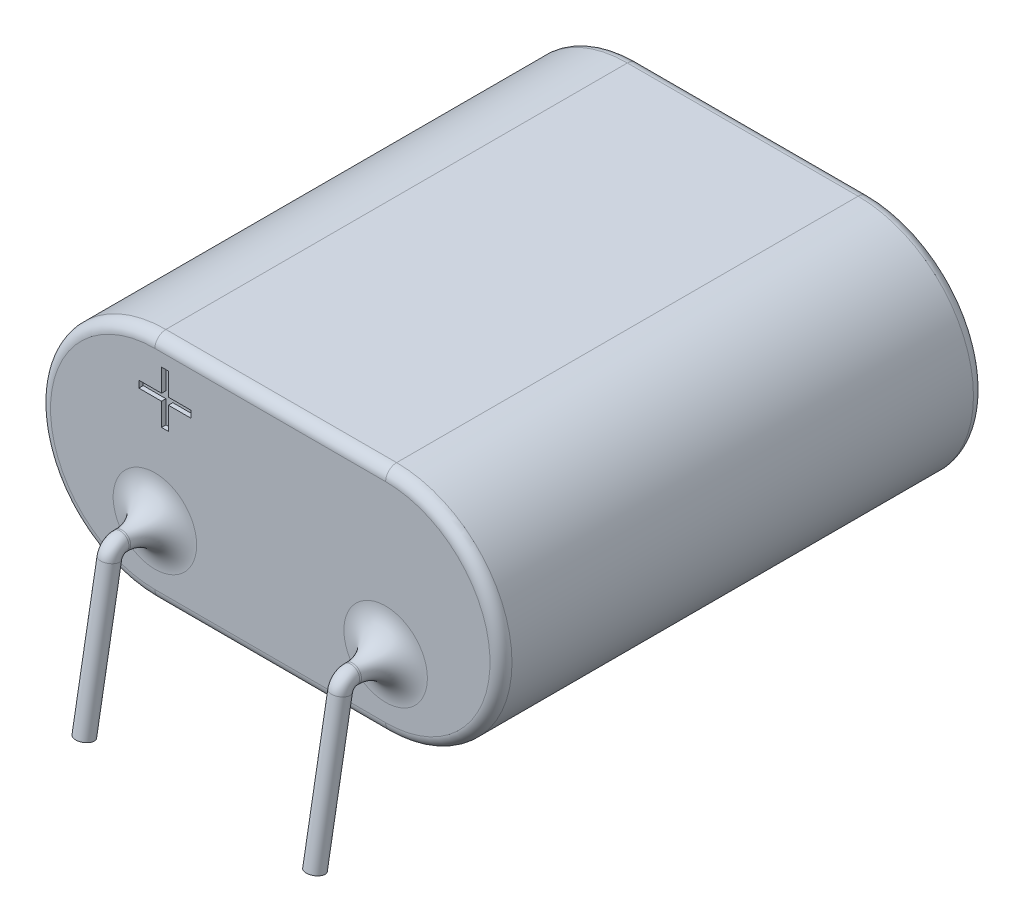
ISO-10303-21;
HEADER;
FILE_DESCRIPTION(('STEP AP214'),'2;1');
FILE_NAME('part.step','',(''),(''),'','','');
FILE_SCHEMA(('AUTOMOTIVE_DESIGN { 1 0 10303 214 1 1 1 1 }'));
ENDSEC;
DATA;
#1=APPLICATION_CONTEXT('core data for automotive mechanical design processes');
#2=APPLICATION_PROTOCOL_DEFINITION('international standard','automotive_design',2000,#1);
#3=PRODUCT_CONTEXT('',#1,'mechanical');
#4=PRODUCT('Part','Part','',(#3));
#5=PRODUCT_RELATED_PRODUCT_CATEGORY('part','',(#4));
#6=PRODUCT_DEFINITION_FORMATION('','',#4);
#7=PRODUCT_DEFINITION_CONTEXT('part definition',#1,'design');
#8=PRODUCT_DEFINITION('design','',#6,#7);
#9=PRODUCT_DEFINITION_SHAPE('','',#8);
#10=(LENGTH_UNIT() NAMED_UNIT(*) SI_UNIT(.MILLI.,.METRE.));
#11=(NAMED_UNIT(*) PLANE_ANGLE_UNIT() SI_UNIT($,.RADIAN.));
#12=(NAMED_UNIT(*) SI_UNIT($,.STERADIAN.) SOLID_ANGLE_UNIT());
#13=UNCERTAINTY_MEASURE_WITH_UNIT(LENGTH_MEASURE(1.E-05),#10,'distance_accuracy_value','');
#14=(GEOMETRIC_REPRESENTATION_CONTEXT(3) GLOBAL_UNCERTAINTY_ASSIGNED_CONTEXT((#13)) GLOBAL_UNIT_ASSIGNED_CONTEXT((#10,
#11,#12)) REPRESENTATION_CONTEXT('',''));
#15=CARTESIAN_POINT('',(0.,0.,0.));
#16=DIRECTION('',(0.,0.,1.));
#17=DIRECTION('',(1.,0.,0.));
#18=AXIS2_PLACEMENT_3D('',#15,#16,#17);
#19=CARTESIAN_POINT('',(0.,0.,0.));
#20=DIRECTION('',(0.,0.,1.));
#21=DIRECTION('',(1.,0.,0.));
#22=AXIS2_PLACEMENT_3D('',#19,#20,#21);
#23=PLANE('',#22);
#24=CARTESIAN_POINT('',(10.5,0.,0.));
#25=DIRECTION('',(0.,0.,1.));
#26=DIRECTION('',(1.,0.,0.));
#27=AXIS2_PLACEMENT_3D('',#24,#25,#26);
#28=CIRCLE('',#27,4.75);
#29=CARTESIAN_POINT('',(10.5,-4.75,0.));
#30=VERTEX_POINT('',#29);
#31=CARTESIAN_POINT('',(10.5,4.75,0.));
#32=VERTEX_POINT('',#31);
#33=EDGE_CURVE('E51',#30,#32,#28,.T.);
#34=ORIENTED_EDGE('',*,*,#33,.T.);
#35=DIRECTION('',(-1.,0.,0.));
#36=VECTOR('',#35,1.);
#37=CARTESIAN_POINT('',(0.,4.75,0.));
#38=LINE('',#37,#36);
#39=CARTESIAN_POINT('',(0.,4.75,0.));
#40=VERTEX_POINT('',#39);
#41=EDGE_CURVE('E11',#32,#40,#38,.T.);
#42=ORIENTED_EDGE('',*,*,#41,.T.);
#43=CARTESIAN_POINT('',(0.,0.,0.));
#44=DIRECTION('',(0.,0.,1.));
#45=DIRECTION('',(1.,0.,0.));
#46=AXIS2_PLACEMENT_3D('',#43,#44,#45);
#47=CIRCLE('',#46,4.75);
#48=CARTESIAN_POINT('',(0.,-4.75,0.));
#49=VERTEX_POINT('',#48);
#50=EDGE_CURVE('E311',#40,#49,#47,.T.);
#51=ORIENTED_EDGE('',*,*,#50,.T.);
#52=DIRECTION('',(1.,0.,0.));
#53=VECTOR('',#52,1.);
#54=CARTESIAN_POINT('',(0.,-4.75,0.));
#55=LINE('',#54,#53);
#56=EDGE_CURVE('E314',#49,#30,#55,.T.);
#57=ORIENTED_EDGE('',*,*,#56,.T.);
#58=EDGE_LOOP('',(#34,#42,#51,#57));
#59=FACE_BOUND('',#58,.T.);
#60=CARTESIAN_POINT('',(10.5,-2.05,0.));
#61=DIRECTION('',(0.,0.,1.));
#62=DIRECTION('',(1.,0.,0.));
#63=AXIS2_PLACEMENT_3D('',#60,#61,#62);
#64=CIRCLE('',#63,1.9);
#65=CARTESIAN_POINT('',(12.4,-2.05,0.));
#66=VERTEX_POINT('',#65);
#67=EDGE_CURVE('E264',#66,#66,#64,.F.);
#68=ORIENTED_EDGE('',*,*,#67,.T.);
#69=EDGE_LOOP('',(#68));
#70=FACE_BOUND('',#69,.T.);
#71=CARTESIAN_POINT('',(0.,-2.05,0.));
#72=DIRECTION('',(0.,0.,1.));
#73=DIRECTION('',(1.,0.,0.));
#74=AXIS2_PLACEMENT_3D('',#71,#72,#73);
#75=CIRCLE('',#74,1.9);
#76=CARTESIAN_POINT('',(1.9,-2.05,0.));
#77=VERTEX_POINT('',#76);
#78=EDGE_CURVE('E260',#77,#77,#75,.F.);
#79=ORIENTED_EDGE('',*,*,#78,.T.);
#80=EDGE_LOOP('',(#79));
#81=FACE_BOUND('',#80,.T.);
#82=DIRECTION('',(0.,1.,0.));
#83=VECTOR('',#82,1.);
#84=CARTESIAN_POINT('',(-0.73076923076923,2.82051282051282,0.));
#85=LINE('',#84,#83);
#86=CARTESIAN_POINT('',(-0.73076923076923,2.82051282051282,0.));
#87=VERTEX_POINT('',#86);
#88=CARTESIAN_POINT('',(-0.73076923076923,3.13461538461538,0.));
#89=VERTEX_POINT('',#88);
#90=EDGE_CURVE('E198',#87,#89,#85,.T.);
#91=ORIENTED_EDGE('',*,*,#90,.T.);
#92=DIRECTION('',(1.,0.,0.));
#93=VECTOR('',#92,1.);
#94=CARTESIAN_POINT('',(-0.73076923076923,3.13461538461538,0.));
#95=LINE('',#94,#93);
#96=CARTESIAN_POINT('',(0.301282051282052,3.13461538461538,0.));
#97=VERTEX_POINT('',#96);
#98=EDGE_CURVE('E59',#89,#97,#95,.T.);
#99=ORIENTED_EDGE('',*,*,#98,.T.);
#100=DIRECTION('',(0.,1.,0.));
#101=VECTOR('',#100,1.);
#102=CARTESIAN_POINT('',(0.301282051282052,3.13461538461538,0.));
#103=LINE('',#102,#101);
#104=CARTESIAN_POINT('',(0.301282051282052,4.16666666666667,0.));
#105=VERTEX_POINT('',#104);
#106=EDGE_CURVE('E202',#97,#105,#103,.T.);
#107=ORIENTED_EDGE('',*,*,#106,.T.);
#108=DIRECTION('',(1.,0.,0.));
#109=VECTOR('',#108,1.);
#110=CARTESIAN_POINT('',(0.301282051282052,4.16666666666667,0.));
#111=LINE('',#110,#109);
#112=CARTESIAN_POINT('',(0.615384615384616,4.16666666666667,0.));
#113=VERTEX_POINT('',#112);
#114=EDGE_CURVE('E752',#105,#113,#111,.T.);
#115=ORIENTED_EDGE('',*,*,#114,.T.);
#116=DIRECTION('',(0.,-1.,0.));
#117=VECTOR('',#116,1.);
#118=CARTESIAN_POINT('',(0.615384615384616,4.16666666666667,0.));
#119=LINE('',#118,#117);
#120=CARTESIAN_POINT('',(0.615384615384616,3.13461538461538,0.));
#121=VERTEX_POINT('',#120);
#122=EDGE_CURVE('E754',#113,#121,#119,.T.);
#123=ORIENTED_EDGE('',*,*,#122,.T.);
#124=DIRECTION('',(1.,0.,0.));
#125=VECTOR('',#124,1.);
#126=CARTESIAN_POINT('',(0.615384615384616,3.13461538461538,0.));
#127=LINE('',#126,#125);
#128=CARTESIAN_POINT('',(1.6474358974359,3.13461538461538,0.));
#129=VERTEX_POINT('',#128);
#130=EDGE_CURVE('E759',#121,#129,#127,.T.);
#131=ORIENTED_EDGE('',*,*,#130,.T.);
#132=DIRECTION('',(0.,-1.,0.));
#133=VECTOR('',#132,1.);
#134=CARTESIAN_POINT('',(1.6474358974359,3.13461538461538,0.));
#135=LINE('',#134,#133);
#136=CARTESIAN_POINT('',(1.6474358974359,2.82051282051282,0.));
#137=VERTEX_POINT('',#136);
#138=EDGE_CURVE('E769',#129,#137,#135,.T.);
#139=ORIENTED_EDGE('',*,*,#138,.T.);
#140=DIRECTION('',(-1.,0.,0.));
#141=VECTOR('',#140,1.);
#142=CARTESIAN_POINT('',(1.6474358974359,2.82051282051282,0.));
#143=LINE('',#142,#141);
#144=CARTESIAN_POINT('',(0.615384615384616,2.82051282051282,0.));
#145=VERTEX_POINT('',#144);
#146=EDGE_CURVE('E773',#137,#145,#143,.T.);
#147=ORIENTED_EDGE('',*,*,#146,.T.);
#148=DIRECTION('',(0.,-1.,0.));
#149=VECTOR('',#148,1.);
#150=CARTESIAN_POINT('',(0.615384615384616,2.82051282051282,0.));
#151=LINE('',#150,#149);
#152=CARTESIAN_POINT('',(0.615384615384616,1.78846153846154,0.));
#153=VERTEX_POINT('',#152);
#154=EDGE_CURVE('E777',#145,#153,#151,.T.);
#155=ORIENTED_EDGE('',*,*,#154,.T.);
#156=DIRECTION('',(-1.,0.,0.));
#157=VECTOR('',#156,1.);
#158=CARTESIAN_POINT('',(0.615384615384616,1.78846153846154,0.));
#159=LINE('',#158,#157);
#160=CARTESIAN_POINT('',(0.301282051282052,1.78846153846154,0.));
#161=VERTEX_POINT('',#160);
#162=EDGE_CURVE('E718',#153,#161,#159,.T.);
#163=ORIENTED_EDGE('',*,*,#162,.T.);
#164=DIRECTION('',(0.,1.,0.));
#165=VECTOR('',#164,1.);
#166=CARTESIAN_POINT('',(0.301282051282052,1.78846153846154,0.));
#167=LINE('',#166,#165);
#168=CARTESIAN_POINT('',(0.301282051282052,2.82051282051282,0.));
#169=VERTEX_POINT('',#168);
#170=EDGE_CURVE('E713',#161,#169,#167,.T.);
#171=ORIENTED_EDGE('',*,*,#170,.T.);
#172=DIRECTION('',(-1.,0.,0.));
#173=VECTOR('',#172,1.);
#174=CARTESIAN_POINT('',(0.301282051282052,2.82051282051282,0.));
#175=LINE('',#174,#173);
#176=EDGE_CURVE('E707',#169,#87,#175,.T.);
#177=ORIENTED_EDGE('',*,*,#176,.T.);
#178=EDGE_LOOP('',(#91,#99,#107,#115,#123,#131,#139,#147,#155,#163,#171,#177));
#179=FACE_BOUND('',#178,.T.);
#180=ADVANCED_FACE('F41',(#59,#70,#81,#179),#23,.T.);
#181=CARTESIAN_POINT('',(0.,0.,-22.));
#182=DIRECTION('',(0.,0.,1.));
#183=DIRECTION('',(1.,0.,0.));
#184=AXIS2_PLACEMENT_3D('',#181,#182,#183);
#185=CYLINDRICAL_SURFACE('',#184,5.25);
#186=DIRECTION('',(0.,0.,1.));
#187=VECTOR('',#186,1.);
#188=CARTESIAN_POINT('',(0.,5.25,-22.));
#189=LINE('',#188,#187);
#190=CARTESIAN_POINT('',(0.,5.25,-21.5));
#191=VERTEX_POINT('',#190);
#192=CARTESIAN_POINT('',(0.,5.25,-0.5));
#193=VERTEX_POINT('',#192);
#194=EDGE_CURVE('E241',#191,#193,#189,.T.);
#195=ORIENTED_EDGE('',*,*,#194,.F.);
#196=CARTESIAN_POINT('',(0.,0.,-21.5));
#197=DIRECTION('',(0.,0.,1.));
#198=DIRECTION('',(1.,0.,0.));
#199=AXIS2_PLACEMENT_3D('',#196,#197,#198);
#200=CIRCLE('',#199,5.25);
#201=CARTESIAN_POINT('',(0.,-5.25,-21.5));
#202=VERTEX_POINT('',#201);
#203=EDGE_CURVE('E308',#191,#202,#200,.T.);
#204=ORIENTED_EDGE('',*,*,#203,.T.);
#205=DIRECTION('',(0.,0.,1.));
#206=VECTOR('',#205,1.);
#207=CARTESIAN_POINT('',(0.,-5.25,-22.));
#208=LINE('',#207,#206);
#209=CARTESIAN_POINT('',(0.,-5.25,-0.5));
#210=VERTEX_POINT('',#209);
#211=EDGE_CURVE('E240',#202,#210,#208,.T.);
#212=ORIENTED_EDGE('',*,*,#211,.T.);
#213=CARTESIAN_POINT('',(0.,0.,-0.5));
#214=DIRECTION('',(0.,0.,1.));
#215=DIRECTION('',(1.,0.,0.));
#216=AXIS2_PLACEMENT_3D('',#213,#214,#215);
#217=CIRCLE('',#216,5.25);
#218=EDGE_CURVE('E305',#210,#193,#217,.F.);
#219=ORIENTED_EDGE('',*,*,#218,.T.);
#220=EDGE_LOOP('',(#195,#204,#212,#219));
#221=FACE_BOUND('',#220,.T.);
#222=ADVANCED_FACE('F356',(#221),#185,.T.);
#223=CARTESIAN_POINT('',(0.,5.25,-22.));
#224=DIRECTION('',(0.,1.,0.));
#225=DIRECTION('',(-1.,0.,0.));
#226=AXIS2_PLACEMENT_3D('',#223,#224,#225);
#227=PLANE('',#226);
#228=DIRECTION('',(0.,0.,1.));
#229=VECTOR('',#228,1.);
#230=CARTESIAN_POINT('',(10.5,5.25,-22.));
#231=LINE('',#230,#229);
#232=CARTESIAN_POINT('',(10.5,5.25,-21.5));
#233=VERTEX_POINT('',#232);
#234=CARTESIAN_POINT('',(10.5,5.25,-0.5));
#235=VERTEX_POINT('',#234);
#236=EDGE_CURVE('E246',#233,#235,#231,.T.);
#237=ORIENTED_EDGE('',*,*,#236,.F.);
#238=DIRECTION('',(-1.,0.,0.));
#239=VECTOR('',#238,1.);
#240=CARTESIAN_POINT('',(0.,5.25,-21.5));
#241=LINE('',#240,#239);
#242=EDGE_CURVE('E302',#233,#191,#241,.T.);
#243=ORIENTED_EDGE('',*,*,#242,.T.);
#244=ORIENTED_EDGE('',*,*,#194,.T.);
#245=DIRECTION('',(-1.,0.,0.));
#246=VECTOR('',#245,1.);
#247=CARTESIAN_POINT('',(0.,5.25,-0.5));
#248=LINE('',#247,#246);
#249=EDGE_CURVE('E298',#193,#235,#248,.F.);
#250=ORIENTED_EDGE('',*,*,#249,.T.);
#251=EDGE_LOOP('',(#237,#243,#244,#250));
#252=FACE_BOUND('',#251,.T.);
#253=ADVANCED_FACE('F373',(#252),#227,.T.);
#254=CARTESIAN_POINT('',(10.5,0.,-22.));
#255=DIRECTION('',(0.,0.,1.));
#256=DIRECTION('',(1.,0.,0.));
#257=AXIS2_PLACEMENT_3D('',#254,#255,#256);
#258=CYLINDRICAL_SURFACE('',#257,5.25);
#259=DIRECTION('',(0.,0.,1.));
#260=VECTOR('',#259,1.);
#261=CARTESIAN_POINT('',(10.5,-5.25,-22.));
#262=LINE('',#261,#260);
#263=CARTESIAN_POINT('',(10.5,-5.25,-21.5));
#264=VERTEX_POINT('',#263);
#265=CARTESIAN_POINT('',(10.5,-5.25,-0.5));
#266=VERTEX_POINT('',#265);
#267=EDGE_CURVE('E250',#264,#266,#262,.T.);
#268=ORIENTED_EDGE('',*,*,#267,.F.);
#269=CARTESIAN_POINT('',(10.5,0.,-21.5));
#270=DIRECTION('',(0.,0.,1.));
#271=DIRECTION('',(1.,0.,0.));
#272=AXIS2_PLACEMENT_3D('',#269,#270,#271);
#273=CIRCLE('',#272,5.25);
#274=EDGE_CURVE('E295',#264,#233,#273,.T.);
#275=ORIENTED_EDGE('',*,*,#274,.T.);
#276=ORIENTED_EDGE('',*,*,#236,.T.);
#277=CARTESIAN_POINT('',(10.5,0.,-0.5));
#278=DIRECTION('',(0.,0.,1.));
#279=DIRECTION('',(1.,0.,0.));
#280=AXIS2_PLACEMENT_3D('',#277,#278,#279);
#281=CIRCLE('',#280,5.25);
#282=EDGE_CURVE('E292',#235,#266,#281,.F.);
#283=ORIENTED_EDGE('',*,*,#282,.T.);
#284=EDGE_LOOP('',(#268,#275,#276,#283));
#285=FACE_BOUND('',#284,.T.);
#286=ADVANCED_FACE('F369',(#285),#258,.T.);
#287=CARTESIAN_POINT('',(0.,-5.25,-22.));
#288=DIRECTION('',(0.,-1.,0.));
#289=DIRECTION('',(1.,0.,0.));
#290=AXIS2_PLACEMENT_3D('',#287,#288,#289);
#291=PLANE('',#290);
#292=ORIENTED_EDGE('',*,*,#211,.F.);
#293=DIRECTION('',(1.,0.,0.));
#294=VECTOR('',#293,1.);
#295=CARTESIAN_POINT('',(10.5,-5.25,-21.5));
#296=LINE('',#295,#294);
#297=EDGE_CURVE('E275',#202,#264,#296,.T.);
#298=ORIENTED_EDGE('',*,*,#297,.T.);
#299=ORIENTED_EDGE('',*,*,#267,.T.);
#300=DIRECTION('',(1.,0.,0.));
#301=VECTOR('',#300,1.);
#302=CARTESIAN_POINT('',(0.,-5.25,-0.5));
#303=LINE('',#302,#301);
#304=EDGE_CURVE('E272',#266,#210,#303,.F.);
#305=ORIENTED_EDGE('',*,*,#304,.T.);
#306=EDGE_LOOP('',(#292,#298,#299,#305));
#307=FACE_BOUND('',#306,.T.);
#308=ADVANCED_FACE('F351',(#307),#291,.T.);
#309=CARTESIAN_POINT('',(0.,0.,-22.));
#310=DIRECTION('',(0.,0.,1.));
#311=DIRECTION('',(1.,0.,0.));
#312=AXIS2_PLACEMENT_3D('',#309,#310,#311);
#313=PLANE('',#312);
#314=CARTESIAN_POINT('',(10.5,0.,-22.));
#315=DIRECTION('',(0.,0.,1.));
#316=DIRECTION('',(1.,0.,0.));
#317=AXIS2_PLACEMENT_3D('',#314,#315,#316);
#318=CIRCLE('',#317,4.75);
#319=CARTESIAN_POINT('',(10.5,4.75,-22.));
#320=VERTEX_POINT('',#319);
#321=CARTESIAN_POINT('',(10.5,-4.75,-22.));
#322=VERTEX_POINT('',#321);
#323=EDGE_CURVE('E285',#320,#322,#318,.F.);
#324=ORIENTED_EDGE('',*,*,#323,.T.);
#325=DIRECTION('',(1.,0.,0.));
#326=VECTOR('',#325,1.);
#327=CARTESIAN_POINT('',(0.,-4.75,-22.));
#328=LINE('',#327,#326);
#329=CARTESIAN_POINT('',(0.,-4.75,-22.));
#330=VERTEX_POINT('',#329);
#331=EDGE_CURVE('E288',#322,#330,#328,.F.);
#332=ORIENTED_EDGE('',*,*,#331,.T.);
#333=CARTESIAN_POINT('',(0.,0.,-22.));
#334=DIRECTION('',(0.,0.,1.));
#335=DIRECTION('',(1.,0.,0.));
#336=AXIS2_PLACEMENT_3D('',#333,#334,#335);
#337=CIRCLE('',#336,4.75);
#338=CARTESIAN_POINT('',(0.,4.75,-22.));
#339=VERTEX_POINT('',#338);
#340=EDGE_CURVE('E279',#330,#339,#337,.F.);
#341=ORIENTED_EDGE('',*,*,#340,.T.);
#342=DIRECTION('',(-1.,0.,0.));
#343=VECTOR('',#342,1.);
#344=CARTESIAN_POINT('',(10.5,4.75,-22.));
#345=LINE('',#344,#343);
#346=EDGE_CURVE('E282',#339,#320,#345,.F.);
#347=ORIENTED_EDGE('',*,*,#346,.T.);
#348=EDGE_LOOP('',(#324,#332,#341,#347));
#349=FACE_BOUND('',#348,.T.);
#350=ADVANCED_FACE('F383',(#349),#313,.F.);
#351=CARTESIAN_POINT('',(0.,-8.94365427108546,3.21553724366849));
#352=DIRECTION('',(0.,-0.984807753012209,0.173648177666926));
#353=DIRECTION('',(1.,0.,0.));
#354=AXIS2_PLACEMENT_3D('',#351,#352,#353);
#355=PLANE('',#354);
#356=CARTESIAN_POINT('',(0.,-8.94365427108546,3.21553724366849));
#357=DIRECTION('',(0.,-0.984807753012209,0.173648177666926));
#358=DIRECTION('',(1.,0.,0.));
#359=AXIS2_PLACEMENT_3D('',#356,#357,#358);
#360=CIRCLE('',#359,0.4);
#361=CARTESIAN_POINT('',(0.4,-8.94365427108546,3.21553724366849));
#362=VERTEX_POINT('',#361);
#363=EDGE_CURVE('E236',#362,#362,#360,.T.);
#364=ORIENTED_EDGE('',*,*,#363,.T.);
#365=EDGE_LOOP('',(#364));
#366=FACE_BOUND('',#365,.T.);
#367=ADVANCED_FACE('F385',(#366),#355,.T.);
#368=CARTESIAN_POINT('',(0.,-2.05,0.));
#369=DIRECTION('',(0.,0.,1.));
#370=DIRECTION('',(1.,0.,0.));
#371=AXIS2_PLACEMENT_3D('',#368,#369,#370);
#372=CYLINDRICAL_SURFACE('',#371,0.4);
#373=CARTESIAN_POINT('',(0.,-2.05,1.5));
#374=DIRECTION('',(0.,0.,1.));
#375=DIRECTION('',(1.,0.,0.));
#376=AXIS2_PLACEMENT_3D('',#373,#374,#375);
#377=CIRCLE('',#376,0.4);
#378=CARTESIAN_POINT('',(0.4,-2.05,1.5));
#379=VERTEX_POINT('',#378);
#380=EDGE_CURVE('E268',#379,#379,#377,.T.);
#381=ORIENTED_EDGE('',*,*,#380,.T.);
#382=EDGE_LOOP('',(#381));
#383=FACE_BOUND('',#382,.T.);
#384=CARTESIAN_POINT('',(0.,-2.05,1.58045018441136));
#385=DIRECTION('',(0.,0.,1.));
#386=DIRECTION('',(1.,0.,0.));
#387=AXIS2_PLACEMENT_3D('',#384,#385,#386);
#388=CIRCLE('',#387,0.4);
#389=CARTESIAN_POINT('',(0.,-1.65,1.58045018441136));
#390=VERTEX_POINT('',#389);
#391=EDGE_CURVE('E228',#390,#390,#388,.T.);
#392=ORIENTED_EDGE('',*,*,#391,.F.);
#393=EDGE_LOOP('',(#392));
#394=FACE_BOUND('',#393,.T.);
#395=ADVANCED_FACE('F392',(#383,#394),#372,.T.);
#396=CARTESIAN_POINT('',(0.,-2.55,1.58045018441136));
#397=DIRECTION('',(1.,0.,0.));
#398=DIRECTION('',(0.,0.,-1.));
#399=AXIS2_PLACEMENT_3D('',#396,#397,#398);
#400=TOROIDAL_SURFACE('',#399,0.5,0.4);
#401=CARTESIAN_POINT('',(0.,-2.46317591116654,2.07285406091746));
#402=DIRECTION('',(0.,-0.984807753012209,0.173648177666926));
#403=DIRECTION('',(1.,0.,0.));
#404=AXIS2_PLACEMENT_3D('',#401,#402,#403);
#405=CIRCLE('',#404,0.4);
#406=CARTESIAN_POINT('',(0.,-2.39371664009977,2.46677716212235));
#407=VERTEX_POINT('',#406);
#408=EDGE_CURVE('E232',#407,#407,#405,.T.);
#409=CARTESIAN_POINT('',(0.,-2.55,1.58045018441136));
#410=DIRECTION('',(1.,0.,0.));
#411=DIRECTION('',(0.,0.,-1.));
#412=AXIS2_PLACEMENT_3D('',#409,#410,#411);
#413=CIRCLE('',#412,0.9);
#414=EDGE_CURVE('',#390,#407,#413,.T.);
#415=ORIENTED_EDGE('',*,*,#391,.T.);
#416=ORIENTED_EDGE('',*,*,#408,.F.);
#417=ORIENTED_EDGE('',*,*,#414,.T.);
#418=ORIENTED_EDGE('',*,*,#414,.F.);
#419=EDGE_LOOP('',(#415,#417,#416,#418));
#420=FACE_BOUND('',#419,.T.);
#421=ADVANCED_FACE('F400',(#420),#400,.T.);
#422=CARTESIAN_POINT('',(0.,-2.46317591116654,2.07285406091746));
#423=DIRECTION('',(0.,-0.984807753012209,0.173648177666926));
#424=DIRECTION('',(0.,-0.173648177666926,-0.984807753012209));
#425=AXIS2_PLACEMENT_3D('',#422,#423,#424);
#426=CYLINDRICAL_SURFACE('',#425,0.4);
#427=ORIENTED_EDGE('',*,*,#363,.F.);
#428=EDGE_LOOP('',(#427));
#429=FACE_BOUND('',#428,.T.);
#430=ORIENTED_EDGE('',*,*,#408,.T.);
#431=EDGE_LOOP('',(#430));
#432=FACE_BOUND('',#431,.T.);
#433=ADVANCED_FACE('F387',(#429,#432),#426,.T.);
#434=CARTESIAN_POINT('',(10.5,-8.94365427108546,3.21553724366849));
#435=DIRECTION('',(0.,-0.984807753012209,0.173648177666926));
#436=DIRECTION('',(1.,0.,0.));
#437=AXIS2_PLACEMENT_3D('',#434,#435,#436);
#438=PLANE('',#437);
#439=CARTESIAN_POINT('',(10.5,-8.94365427108546,3.21553724366849));
#440=DIRECTION('',(0.,-0.984807753012209,0.173648177666926));
#441=DIRECTION('',(1.,0.,0.));
#442=AXIS2_PLACEMENT_3D('',#439,#440,#441);
#443=CIRCLE('',#442,0.399999999999999);
#444=CARTESIAN_POINT('',(10.9,-8.94365427108546,3.21553724366849));
#445=VERTEX_POINT('',#444);
#446=EDGE_CURVE('E224',#445,#445,#443,.T.);
#447=ORIENTED_EDGE('',*,*,#446,.T.);
#448=EDGE_LOOP('',(#447));
#449=FACE_BOUND('',#448,.T.);
#450=ADVANCED_FACE('F399',(#449),#438,.T.);
#451=CARTESIAN_POINT('',(10.5,-2.05,0.));
#452=DIRECTION('',(0.,0.,1.));
#453=DIRECTION('',(1.,0.,0.));
#454=AXIS2_PLACEMENT_3D('',#451,#452,#453);
#455=CYLINDRICAL_SURFACE('',#454,0.399999999999999);
#456=CARTESIAN_POINT('',(10.5,-2.05,1.5));
#457=DIRECTION('',(0.,0.,1.));
#458=DIRECTION('',(1.,0.,0.));
#459=AXIS2_PLACEMENT_3D('',#456,#457,#458);
#460=CIRCLE('',#459,0.399999999999999);
#461=CARTESIAN_POINT('',(10.9,-2.05,1.5));
#462=VERTEX_POINT('',#461);
#463=EDGE_CURVE('E245',#462,#462,#460,.T.);
#464=ORIENTED_EDGE('',*,*,#463,.T.);
#465=EDGE_LOOP('',(#464));
#466=FACE_BOUND('',#465,.T.);
#467=CARTESIAN_POINT('',(10.5,-2.05,1.58045018441136));
#468=DIRECTION('',(0.,0.,1.));
#469=DIRECTION('',(1.,0.,0.));
#470=AXIS2_PLACEMENT_3D('',#467,#468,#469);
#471=CIRCLE('',#470,0.399999999999999);
#472=CARTESIAN_POINT('',(10.5,-1.65,1.58045018441136));
#473=VERTEX_POINT('',#472);
#474=EDGE_CURVE('E215',#473,#473,#471,.T.);
#475=ORIENTED_EDGE('',*,*,#474,.F.);
#476=EDGE_LOOP('',(#475));
#477=FACE_BOUND('',#476,.T.);
#478=ADVANCED_FACE('F483',(#466,#477),#455,.T.);
#479=CARTESIAN_POINT('',(10.5,-2.55,1.58045018441136));
#480=DIRECTION('',(1.,0.,0.));
#481=DIRECTION('',(0.,0.,-1.));
#482=AXIS2_PLACEMENT_3D('',#479,#480,#481);
#483=TOROIDAL_SURFACE('',#482,0.5,0.399999999999999);
#484=CARTESIAN_POINT('',(10.5,-2.46317591116654,2.07285406091746));
#485=DIRECTION('',(0.,-0.984807753012209,0.173648177666926));
#486=DIRECTION('',(1.,0.,0.));
#487=AXIS2_PLACEMENT_3D('',#484,#485,#486);
#488=CIRCLE('',#487,0.399999999999999);
#489=CARTESIAN_POINT('',(10.5,-2.39371664009977,2.46677716212235));
#490=VERTEX_POINT('',#489);
#491=EDGE_CURVE('E219',#490,#490,#488,.T.);
#492=CARTESIAN_POINT('',(10.5,-2.55,1.58045018441136));
#493=DIRECTION('',(1.,0.,0.));
#494=DIRECTION('',(0.,0.,-1.));
#495=AXIS2_PLACEMENT_3D('',#492,#493,#494);
#496=CIRCLE('',#495,0.9);
#497=EDGE_CURVE('',#473,#490,#496,.T.);
#498=ORIENTED_EDGE('',*,*,#474,.T.);
#499=ORIENTED_EDGE('',*,*,#491,.F.);
#500=ORIENTED_EDGE('',*,*,#497,.T.);
#501=ORIENTED_EDGE('',*,*,#497,.F.);
#502=EDGE_LOOP('',(#498,#500,#499,#501));
#503=FACE_BOUND('',#502,.T.);
#504=ADVANCED_FACE('F474',(#503),#483,.T.);
#505=CARTESIAN_POINT('',(10.5,-2.46317591116654,2.07285406091746));
#506=DIRECTION('',(0.,-0.984807753012209,0.173648177666926));
#507=DIRECTION('',(0.,-0.173648177666926,-0.984807753012209));
#508=AXIS2_PLACEMENT_3D('',#505,#506,#507);
#509=CYLINDRICAL_SURFACE('',#508,0.399999999999999);
#510=ORIENTED_EDGE('',*,*,#446,.F.);
#511=EDGE_LOOP('',(#510));
#512=FACE_BOUND('',#511,.T.);
#513=ORIENTED_EDGE('',*,*,#491,.T.);
#514=EDGE_LOOP('',(#513));
#515=FACE_BOUND('',#514,.T.);
#516=ADVANCED_FACE('F395',(#512,#515),#509,.T.);
#517=CARTESIAN_POINT('',(10.5,-2.05,1.5));
#518=DIRECTION('',(0.,0.,1.));
#519=DIRECTION('',(1.,0.,0.));
#520=AXIS2_PLACEMENT_3D('',#517,#518,#519);
#521=TOROIDAL_SURFACE('',#520,1.9,1.5);
#522=ORIENTED_EDGE('',*,*,#67,.F.);
#523=EDGE_LOOP('',(#522));
#524=FACE_BOUND('',#523,.T.);
#525=ORIENTED_EDGE('',*,*,#463,.F.);
#526=EDGE_LOOP('',(#525));
#527=FACE_BOUND('',#526,.T.);
#528=ADVANCED_FACE('F414',(#524,#527),#521,.F.);
#529=CARTESIAN_POINT('',(0.,-2.05,1.5));
#530=DIRECTION('',(0.,0.,1.));
#531=DIRECTION('',(1.,0.,0.));
#532=AXIS2_PLACEMENT_3D('',#529,#530,#531);
#533=TOROIDAL_SURFACE('',#532,1.9,1.5);
#534=ORIENTED_EDGE('',*,*,#78,.F.);
#535=EDGE_LOOP('',(#534));
#536=FACE_BOUND('',#535,.T.);
#537=ORIENTED_EDGE('',*,*,#380,.F.);
#538=EDGE_LOOP('',(#537));
#539=FACE_BOUND('',#538,.T.);
#540=ADVANCED_FACE('F417',(#536,#539),#533,.F.);
#541=CARTESIAN_POINT('',(0.,4.75,-21.5));
#542=DIRECTION('',(1.,0.,0.));
#543=DIRECTION('',(0.,1.,0.));
#544=AXIS2_PLACEMENT_3D('',#541,#542,#543);
#545=CYLINDRICAL_SURFACE('',#544,0.5);
#546=CARTESIAN_POINT('',(10.5,4.75,-21.5));
#547=DIRECTION('',(1.,0.,0.));
#548=DIRECTION('',(0.,0.,-1.));
#549=AXIS2_PLACEMENT_3D('',#546,#547,#548);
#550=CIRCLE('',#549,0.5);
#551=EDGE_CURVE('E325',#320,#233,#550,.T.);
#552=ORIENTED_EDGE('',*,*,#551,.F.);
#553=ORIENTED_EDGE('',*,*,#346,.F.);
#554=CARTESIAN_POINT('',(0.,4.75,-21.5));
#555=DIRECTION('',(-1.,0.,0.));
#556=DIRECTION('',(0.,-1.,0.));
#557=AXIS2_PLACEMENT_3D('',#554,#555,#556);
#558=CIRCLE('',#557,0.5);
#559=EDGE_CURVE('E220',#191,#339,#558,.T.);
#560=ORIENTED_EDGE('',*,*,#559,.F.);
#561=ORIENTED_EDGE('',*,*,#242,.F.);
#562=EDGE_LOOP('',(#552,#553,#560,#561));
#563=FACE_BOUND('',#562,.T.);
#564=ADVANCED_FACE('F377',(#563),#545,.T.);
#565=CARTESIAN_POINT('',(0.,0.,-21.5));
#566=DIRECTION('',(0.,0.,1.));
#567=DIRECTION('',(1.,0.,0.));
#568=AXIS2_PLACEMENT_3D('',#565,#566,#567);
#569=TOROIDAL_SURFACE('',#568,4.75,0.5);
#570=ORIENTED_EDGE('',*,*,#559,.T.);
#571=ORIENTED_EDGE('',*,*,#340,.F.);
#572=CARTESIAN_POINT('',(0.,-4.75,-21.5));
#573=DIRECTION('',(1.,0.,0.));
#574=DIRECTION('',(0.,0.,-1.));
#575=AXIS2_PLACEMENT_3D('',#572,#573,#574);
#576=CIRCLE('',#575,0.5);
#577=EDGE_CURVE('E322',#202,#330,#576,.T.);
#578=ORIENTED_EDGE('',*,*,#577,.F.);
#579=ORIENTED_EDGE('',*,*,#203,.F.);
#580=EDGE_LOOP('',(#570,#571,#578,#579));
#581=FACE_BOUND('',#580,.T.);
#582=ADVANCED_FACE('F360',(#581),#569,.T.);
#583=CARTESIAN_POINT('',(10.5,0.,-21.5));
#584=DIRECTION('',(0.,0.,1.));
#585=DIRECTION('',(1.,0.,0.));
#586=AXIS2_PLACEMENT_3D('',#583,#584,#585);
#587=TOROIDAL_SURFACE('',#586,4.75,0.5);
#588=ORIENTED_EDGE('',*,*,#551,.T.);
#589=ORIENTED_EDGE('',*,*,#274,.F.);
#590=CARTESIAN_POINT('',(10.5,-4.75,-21.5));
#591=DIRECTION('',(-1.,0.,0.));
#592=DIRECTION('',(0.,0.,1.));
#593=AXIS2_PLACEMENT_3D('',#590,#591,#592);
#594=CIRCLE('',#593,0.5);
#595=EDGE_CURVE('E319',#322,#264,#594,.T.);
#596=ORIENTED_EDGE('',*,*,#595,.F.);
#597=ORIENTED_EDGE('',*,*,#323,.F.);
#598=EDGE_LOOP('',(#588,#589,#596,#597));
#599=FACE_BOUND('',#598,.T.);
#600=ADVANCED_FACE('F381',(#599),#587,.T.);
#601=CARTESIAN_POINT('',(0.,-4.75,-21.5));
#602=DIRECTION('',(-1.,0.,0.));
#603=DIRECTION('',(0.,-1.,0.));
#604=AXIS2_PLACEMENT_3D('',#601,#602,#603);
#605=CYLINDRICAL_SURFACE('',#604,0.5);
#606=ORIENTED_EDGE('',*,*,#577,.T.);
#607=ORIENTED_EDGE('',*,*,#331,.F.);
#608=ORIENTED_EDGE('',*,*,#595,.T.);
#609=ORIENTED_EDGE('',*,*,#297,.F.);
#610=EDGE_LOOP('',(#606,#607,#608,#609));
#611=FACE_BOUND('',#610,.T.);
#612=ADVANCED_FACE('F365',(#611),#605,.T.);
#613=CARTESIAN_POINT('',(0.,-4.75,-0.5));
#614=DIRECTION('',(1.,0.,0.));
#615=DIRECTION('',(0.,1.,0.));
#616=AXIS2_PLACEMENT_3D('',#613,#614,#615);
#617=CYLINDRICAL_SURFACE('',#616,0.5);
#618=CARTESIAN_POINT('',(0.,-4.75,-0.5));
#619=DIRECTION('',(-1.,0.,0.));
#620=DIRECTION('',(0.,-1.,0.));
#621=AXIS2_PLACEMENT_3D('',#618,#619,#620);
#622=CIRCLE('',#621,0.5);
#623=EDGE_CURVE('E333',#210,#49,#622,.T.);
#624=ORIENTED_EDGE('',*,*,#623,.F.);
#625=ORIENTED_EDGE('',*,*,#304,.F.);
#626=CARTESIAN_POINT('',(10.5,-4.75,-0.5));
#627=DIRECTION('',(1.,0.,0.));
#628=DIRECTION('',(0.,0.,-1.));
#629=AXIS2_PLACEMENT_3D('',#626,#627,#628);
#630=CIRCLE('',#629,0.5);
#631=EDGE_CURVE('E45',#30,#266,#630,.T.);
#632=ORIENTED_EDGE('',*,*,#631,.F.);
#633=ORIENTED_EDGE('',*,*,#56,.F.);
#634=EDGE_LOOP('',(#624,#625,#632,#633));
#635=FACE_BOUND('',#634,.T.);
#636=ADVANCED_FACE('F43',(#635),#617,.T.);
#637=CARTESIAN_POINT('',(10.5,0.,-0.5));
#638=DIRECTION('',(0.,0.,1.));
#639=DIRECTION('',(1.,0.,0.));
#640=AXIS2_PLACEMENT_3D('',#637,#638,#639);
#641=TOROIDAL_SURFACE('',#640,4.75,0.5);
#642=ORIENTED_EDGE('',*,*,#631,.T.);
#643=ORIENTED_EDGE('',*,*,#282,.F.);
#644=CARTESIAN_POINT('',(10.5,4.75,-0.5));
#645=DIRECTION('',(-1.,0.,0.));
#646=DIRECTION('',(0.,0.,1.));
#647=AXIS2_PLACEMENT_3D('',#644,#645,#646);
#648=CIRCLE('',#647,0.5);
#649=EDGE_CURVE('E209',#32,#235,#648,.T.);
#650=ORIENTED_EDGE('',*,*,#649,.F.);
#651=ORIENTED_EDGE('',*,*,#33,.F.);
#652=EDGE_LOOP('',(#642,#643,#650,#651));
#653=FACE_BOUND('',#652,.T.);
#654=ADVANCED_FACE('F345',(#653),#641,.T.);
#655=CARTESIAN_POINT('',(0.,0.,-0.5));
#656=DIRECTION('',(0.,0.,1.));
#657=DIRECTION('',(1.,0.,0.));
#658=AXIS2_PLACEMENT_3D('',#655,#656,#657);
#659=TOROIDAL_SURFACE('',#658,4.75,0.5);
#660=ORIENTED_EDGE('',*,*,#623,.T.);
#661=ORIENTED_EDGE('',*,*,#50,.F.);
#662=CARTESIAN_POINT('',(0.,4.75,-0.5));
#663=DIRECTION('',(1.,0.,0.));
#664=DIRECTION('',(0.,0.,-1.));
#665=AXIS2_PLACEMENT_3D('',#662,#663,#664);
#666=CIRCLE('',#665,0.5);
#667=EDGE_CURVE('E204',#193,#40,#666,.T.);
#668=ORIENTED_EDGE('',*,*,#667,.F.);
#669=ORIENTED_EDGE('',*,*,#218,.F.);
#670=EDGE_LOOP('',(#660,#661,#668,#669));
#671=FACE_BOUND('',#670,.T.);
#672=ADVANCED_FACE('F433',(#671),#659,.T.);
#673=CARTESIAN_POINT('',(0.,4.75,-0.5));
#674=DIRECTION('',(-1.,0.,0.));
#675=DIRECTION('',(0.,-1.,0.));
#676=AXIS2_PLACEMENT_3D('',#673,#674,#675);
#677=CYLINDRICAL_SURFACE('',#676,0.5);
#678=ORIENTED_EDGE('',*,*,#649,.T.);
#679=ORIENTED_EDGE('',*,*,#249,.F.);
#680=ORIENTED_EDGE('',*,*,#667,.T.);
#681=ORIENTED_EDGE('',*,*,#41,.F.);
#682=EDGE_LOOP('',(#678,#679,#680,#681));
#683=FACE_BOUND('',#682,.T.);
#684=ADVANCED_FACE('F430',(#683),#677,.T.);
#685=CARTESIAN_POINT('',(-0.73076923076923,3.13461538461538,-0.2));
#686=DIRECTION('',(0.,-1.,0.));
#687=DIRECTION('',(0.,0.,-1.));
#688=AXIS2_PLACEMENT_3D('',#685,#686,#687);
#689=PLANE('',#688);
#690=ORIENTED_EDGE('',*,*,#98,.F.);
#691=DIRECTION('',(0.,0.,1.));
#692=VECTOR('',#691,1.);
#693=CARTESIAN_POINT('',(-0.73076923076923,3.13461538461538,-0.2));
#694=LINE('',#693,#692);
#695=CARTESIAN_POINT('',(-0.73076923076923,3.13461538461538,-0.2));
#696=VERTEX_POINT('',#695);
#697=EDGE_CURVE('E196',#696,#89,#694,.T.);
#698=ORIENTED_EDGE('',*,*,#697,.F.);
#699=DIRECTION('',(1.,0.,0.));
#700=VECTOR('',#699,1.);
#701=CARTESIAN_POINT('',(-0.73076923076923,3.13461538461538,-0.2));
#702=LINE('',#701,#700);
#703=CARTESIAN_POINT('',(0.301282051282052,3.13461538461538,-0.2));
#704=VERTEX_POINT('',#703);
#705=EDGE_CURVE('E186',#696,#704,#702,.T.);
#706=ORIENTED_EDGE('',*,*,#705,.T.);
#707=DIRECTION('',(0.,0.,1.));
#708=VECTOR('',#707,1.);
#709=CARTESIAN_POINT('',(0.301282051282052,3.13461538461538,-0.2));
#710=LINE('',#709,#708);
#711=EDGE_CURVE('E195',#704,#97,#710,.T.);
#712=ORIENTED_EDGE('',*,*,#711,.T.);
#713=EDGE_LOOP('',(#690,#698,#706,#712));
#714=FACE_BOUND('',#713,.T.);
#715=ADVANCED_FACE('F194',(#714),#689,.T.);
#716=CARTESIAN_POINT('',(0.301282051282052,3.13461538461538,-0.2));
#717=DIRECTION('',(1.,0.,0.));
#718=DIRECTION('',(0.,0.,-1.));
#719=AXIS2_PLACEMENT_3D('',#716,#717,#718);
#720=PLANE('',#719);
#721=ORIENTED_EDGE('',*,*,#106,.F.);
#722=ORIENTED_EDGE('',*,*,#711,.F.);
#723=DIRECTION('',(0.,1.,0.));
#724=VECTOR('',#723,1.);
#725=CARTESIAN_POINT('',(0.301282051282052,3.13461538461538,-0.2));
#726=LINE('',#725,#724);
#727=CARTESIAN_POINT('',(0.301282051282052,4.16666666666667,-0.2));
#728=VERTEX_POINT('',#727);
#729=EDGE_CURVE('E182',#704,#728,#726,.T.);
#730=ORIENTED_EDGE('',*,*,#729,.T.);
#731=DIRECTION('',(0.,0.,1.));
#732=VECTOR('',#731,1.);
#733=CARTESIAN_POINT('',(0.301282051282052,4.16666666666667,-0.2));
#734=LINE('',#733,#732);
#735=EDGE_CURVE('E205',#728,#105,#734,.T.);
#736=ORIENTED_EDGE('',*,*,#735,.T.);
#737=EDGE_LOOP('',(#721,#722,#730,#736));
#738=FACE_BOUND('',#737,.T.);
#739=ADVANCED_FACE('F200',(#738),#720,.T.);
#740=CARTESIAN_POINT('',(0.301282051282052,4.16666666666667,-0.2));
#741=DIRECTION('',(0.,-1.,0.));
#742=DIRECTION('',(0.,0.,-1.));
#743=AXIS2_PLACEMENT_3D('',#740,#741,#742);
#744=PLANE('',#743);
#745=ORIENTED_EDGE('',*,*,#114,.F.);
#746=ORIENTED_EDGE('',*,*,#735,.F.);
#747=DIRECTION('',(1.,0.,0.));
#748=VECTOR('',#747,1.);
#749=CARTESIAN_POINT('',(0.301282051282052,4.16666666666667,-0.2));
#750=LINE('',#749,#748);
#751=CARTESIAN_POINT('',(0.615384615384616,4.16666666666667,-0.2));
#752=VERTEX_POINT('',#751);
#753=EDGE_CURVE('E188',#728,#752,#750,.T.);
#754=ORIENTED_EDGE('',*,*,#753,.T.);
#755=DIRECTION('',(0.,0.,1.));
#756=VECTOR('',#755,1.);
#757=CARTESIAN_POINT('',(0.615384615384616,4.16666666666667,-0.2));
#758=LINE('',#757,#756);
#759=EDGE_CURVE('E211',#752,#113,#758,.T.);
#760=ORIENTED_EDGE('',*,*,#759,.T.);
#761=EDGE_LOOP('',(#745,#746,#754,#760));
#762=FACE_BOUND('',#761,.T.);
#763=ADVANCED_FACE('F587',(#762),#744,.T.);
#764=CARTESIAN_POINT('',(0.615384615384616,4.16666666666667,-0.2));
#765=DIRECTION('',(-1.,0.,0.));
#766=DIRECTION('',(0.,0.,1.));
#767=AXIS2_PLACEMENT_3D('',#764,#765,#766);
#768=PLANE('',#767);
#769=ORIENTED_EDGE('',*,*,#122,.F.);
#770=ORIENTED_EDGE('',*,*,#759,.F.);
#771=DIRECTION('',(0.,-1.,0.));
#772=VECTOR('',#771,1.);
#773=CARTESIAN_POINT('',(0.615384615384616,4.16666666666667,-0.2));
#774=LINE('',#773,#772);
#775=CARTESIAN_POINT('',(0.615384615384616,3.13461538461538,-0.2));
#776=VERTEX_POINT('',#775);
#777=EDGE_CURVE('E813',#752,#776,#774,.T.);
#778=ORIENTED_EDGE('',*,*,#777,.T.);
#779=DIRECTION('',(0.,0.,1.));
#780=VECTOR('',#779,1.);
#781=CARTESIAN_POINT('',(0.615384615384616,3.13461538461538,-0.2));
#782=LINE('',#781,#780);
#783=EDGE_CURVE('E745',#776,#121,#782,.T.);
#784=ORIENTED_EDGE('',*,*,#783,.T.);
#785=EDGE_LOOP('',(#769,#770,#778,#784));
#786=FACE_BOUND('',#785,.T.);
#787=ADVANCED_FACE('F595',(#786),#768,.T.);
#788=CARTESIAN_POINT('',(0.615384615384616,3.13461538461538,-0.2));
#789=DIRECTION('',(0.,-1.,0.));
#790=DIRECTION('',(0.,0.,-1.));
#791=AXIS2_PLACEMENT_3D('',#788,#789,#790);
#792=PLANE('',#791);
#793=ORIENTED_EDGE('',*,*,#130,.F.);
#794=ORIENTED_EDGE('',*,*,#783,.F.);
#795=DIRECTION('',(1.,0.,0.));
#796=VECTOR('',#795,1.);
#797=CARTESIAN_POINT('',(0.615384615384616,3.13461538461538,-0.2));
#798=LINE('',#797,#796);
#799=CARTESIAN_POINT('',(1.6474358974359,3.13461538461538,-0.2));
#800=VERTEX_POINT('',#799);
#801=EDGE_CURVE('E810',#776,#800,#798,.T.);
#802=ORIENTED_EDGE('',*,*,#801,.T.);
#803=DIRECTION('',(0.,0.,1.));
#804=VECTOR('',#803,1.);
#805=CARTESIAN_POINT('',(1.6474358974359,3.13461538461538,-0.2));
#806=LINE('',#805,#804);
#807=EDGE_CURVE('E742',#800,#129,#806,.T.);
#808=ORIENTED_EDGE('',*,*,#807,.T.);
#809=EDGE_LOOP('',(#793,#794,#802,#808));
#810=FACE_BOUND('',#809,.T.);
#811=ADVANCED_FACE('F604',(#810),#792,.T.);
#812=CARTESIAN_POINT('',(1.6474358974359,3.13461538461538,-0.2));
#813=DIRECTION('',(-1.,0.,0.));
#814=DIRECTION('',(0.,0.,1.));
#815=AXIS2_PLACEMENT_3D('',#812,#813,#814);
#816=PLANE('',#815);
#817=ORIENTED_EDGE('',*,*,#138,.F.);
#818=ORIENTED_EDGE('',*,*,#807,.F.);
#819=DIRECTION('',(0.,-1.,0.));
#820=VECTOR('',#819,1.);
#821=CARTESIAN_POINT('',(1.6474358974359,3.13461538461538,-0.2));
#822=LINE('',#821,#820);
#823=CARTESIAN_POINT('',(1.6474358974359,2.82051282051282,-0.2));
#824=VERTEX_POINT('',#823);
#825=EDGE_CURVE('E807',#800,#824,#822,.T.);
#826=ORIENTED_EDGE('',*,*,#825,.T.);
#827=DIRECTION('',(0.,0.,1.));
#828=VECTOR('',#827,1.);
#829=CARTESIAN_POINT('',(1.6474358974359,2.82051282051282,-0.2));
#830=LINE('',#829,#828);
#831=EDGE_CURVE('E739',#824,#137,#830,.T.);
#832=ORIENTED_EDGE('',*,*,#831,.T.);
#833=EDGE_LOOP('',(#817,#818,#826,#832));
#834=FACE_BOUND('',#833,.T.);
#835=ADVANCED_FACE('F613',(#834),#816,.T.);
#836=CARTESIAN_POINT('',(1.6474358974359,2.82051282051282,-0.2));
#837=DIRECTION('',(0.,1.,0.));
#838=DIRECTION('',(0.,0.,1.));
#839=AXIS2_PLACEMENT_3D('',#836,#837,#838);
#840=PLANE('',#839);
#841=ORIENTED_EDGE('',*,*,#146,.F.);
#842=ORIENTED_EDGE('',*,*,#831,.F.);
#843=DIRECTION('',(-1.,0.,0.));
#844=VECTOR('',#843,1.);
#845=CARTESIAN_POINT('',(1.6474358974359,2.82051282051282,-0.2));
#846=LINE('',#845,#844);
#847=CARTESIAN_POINT('',(0.615384615384616,2.82051282051282,-0.2));
#848=VERTEX_POINT('',#847);
#849=EDGE_CURVE('E804',#824,#848,#846,.T.);
#850=ORIENTED_EDGE('',*,*,#849,.T.);
#851=DIRECTION('',(0.,0.,1.));
#852=VECTOR('',#851,1.);
#853=CARTESIAN_POINT('',(0.615384615384616,2.82051282051282,-0.2));
#854=LINE('',#853,#852);
#855=EDGE_CURVE('E736',#848,#145,#854,.T.);
#856=ORIENTED_EDGE('',*,*,#855,.T.);
#857=EDGE_LOOP('',(#841,#842,#850,#856));
#858=FACE_BOUND('',#857,.T.);
#859=ADVANCED_FACE('F622',(#858),#840,.T.);
#860=CARTESIAN_POINT('',(0.615384615384616,2.82051282051282,-0.2));
#861=DIRECTION('',(-1.,0.,0.));
#862=DIRECTION('',(0.,0.,1.));
#863=AXIS2_PLACEMENT_3D('',#860,#861,#862);
#864=PLANE('',#863);
#865=ORIENTED_EDGE('',*,*,#154,.F.);
#866=ORIENTED_EDGE('',*,*,#855,.F.);
#867=DIRECTION('',(0.,-1.,0.));
#868=VECTOR('',#867,1.);
#869=CARTESIAN_POINT('',(0.615384615384616,2.82051282051282,-0.2));
#870=LINE('',#869,#868);
#871=CARTESIAN_POINT('',(0.615384615384616,1.78846153846154,-0.2));
#872=VERTEX_POINT('',#871);
#873=EDGE_CURVE('E801',#848,#872,#870,.T.);
#874=ORIENTED_EDGE('',*,*,#873,.T.);
#875=DIRECTION('',(0.,0.,1.));
#876=VECTOR('',#875,1.);
#877=CARTESIAN_POINT('',(0.615384615384616,1.78846153846154,-0.2));
#878=LINE('',#877,#876);
#879=EDGE_CURVE('E733',#872,#153,#878,.T.);
#880=ORIENTED_EDGE('',*,*,#879,.T.);
#881=EDGE_LOOP('',(#865,#866,#874,#880));
#882=FACE_BOUND('',#881,.T.);
#883=ADVANCED_FACE('F631',(#882),#864,.T.);
#884=CARTESIAN_POINT('',(0.615384615384616,1.78846153846154,-0.2));
#885=DIRECTION('',(0.,1.,0.));
#886=DIRECTION('',(0.,0.,1.));
#887=AXIS2_PLACEMENT_3D('',#884,#885,#886);
#888=PLANE('',#887);
#889=ORIENTED_EDGE('',*,*,#162,.F.);
#890=ORIENTED_EDGE('',*,*,#879,.F.);
#891=DIRECTION('',(-1.,0.,0.));
#892=VECTOR('',#891,1.);
#893=CARTESIAN_POINT('',(0.615384615384616,1.78846153846154,-0.2));
#894=LINE('',#893,#892);
#895=CARTESIAN_POINT('',(0.301282051282052,1.78846153846154,-0.2));
#896=VERTEX_POINT('',#895);
#897=EDGE_CURVE('E786',#872,#896,#894,.T.);
#898=ORIENTED_EDGE('',*,*,#897,.T.);
#899=DIRECTION('',(0.,0.,1.));
#900=VECTOR('',#899,1.);
#901=CARTESIAN_POINT('',(0.301282051282052,1.78846153846154,-0.2));
#902=LINE('',#901,#900);
#903=EDGE_CURVE('E730',#896,#161,#902,.T.);
#904=ORIENTED_EDGE('',*,*,#903,.T.);
#905=EDGE_LOOP('',(#889,#890,#898,#904));
#906=FACE_BOUND('',#905,.T.);
#907=ADVANCED_FACE('F640',(#906),#888,.T.);
#908=CARTESIAN_POINT('',(0.301282051282052,1.78846153846154,-0.2));
#909=DIRECTION('',(1.,0.,0.));
#910=DIRECTION('',(0.,0.,-1.));
#911=AXIS2_PLACEMENT_3D('',#908,#909,#910);
#912=PLANE('',#911);
#913=ORIENTED_EDGE('',*,*,#170,.F.);
#914=ORIENTED_EDGE('',*,*,#903,.F.);
#915=DIRECTION('',(0.,1.,0.));
#916=VECTOR('',#915,1.);
#917=CARTESIAN_POINT('',(0.301282051282052,1.78846153846154,-0.2));
#918=LINE('',#917,#916);
#919=CARTESIAN_POINT('',(0.301282051282052,2.82051282051282,-0.2));
#920=VERTEX_POINT('',#919);
#921=EDGE_CURVE('E788',#896,#920,#918,.T.);
#922=ORIENTED_EDGE('',*,*,#921,.T.);
#923=DIRECTION('',(0.,0.,1.));
#924=VECTOR('',#923,1.);
#925=CARTESIAN_POINT('',(0.301282051282052,2.82051282051282,-0.2));
#926=LINE('',#925,#924);
#927=EDGE_CURVE('E727',#920,#169,#926,.T.);
#928=ORIENTED_EDGE('',*,*,#927,.T.);
#929=EDGE_LOOP('',(#913,#914,#922,#928));
#930=FACE_BOUND('',#929,.T.);
#931=ADVANCED_FACE('F649',(#930),#912,.T.);
#932=CARTESIAN_POINT('',(0.301282051282052,2.82051282051282,-0.2));
#933=DIRECTION('',(0.,1.,0.));
#934=DIRECTION('',(0.,0.,1.));
#935=AXIS2_PLACEMENT_3D('',#932,#933,#934);
#936=PLANE('',#935);
#937=ORIENTED_EDGE('',*,*,#176,.F.);
#938=ORIENTED_EDGE('',*,*,#927,.F.);
#939=DIRECTION('',(-1.,0.,0.));
#940=VECTOR('',#939,1.);
#941=CARTESIAN_POINT('',(0.301282051282052,2.82051282051282,-0.2));
#942=LINE('',#941,#940);
#943=CARTESIAN_POINT('',(-0.73076923076923,2.82051282051282,-0.2));
#944=VERTEX_POINT('',#943);
#945=EDGE_CURVE('E790',#920,#944,#942,.T.);
#946=ORIENTED_EDGE('',*,*,#945,.T.);
#947=DIRECTION('',(0.,0.,1.));
#948=VECTOR('',#947,1.);
#949=CARTESIAN_POINT('',(-0.73076923076923,2.82051282051282,-0.2));
#950=LINE('',#949,#948);
#951=EDGE_CURVE('E704',#944,#87,#950,.T.);
#952=ORIENTED_EDGE('',*,*,#951,.T.);
#953=EDGE_LOOP('',(#937,#938,#946,#952));
#954=FACE_BOUND('',#953,.T.);
#955=ADVANCED_FACE('F658',(#954),#936,.T.);
#956=CARTESIAN_POINT('',(-0.73076923076923,2.82051282051282,-0.2));
#957=DIRECTION('',(1.,0.,0.));
#958=DIRECTION('',(0.,0.,-1.));
#959=AXIS2_PLACEMENT_3D('',#956,#957,#958);
#960=PLANE('',#959);
#961=ORIENTED_EDGE('',*,*,#90,.F.);
#962=ORIENTED_EDGE('',*,*,#951,.F.);
#963=DIRECTION('',(0.,1.,0.));
#964=VECTOR('',#963,1.);
#965=CARTESIAN_POINT('',(-0.73076923076923,2.82051282051282,-0.2));
#966=LINE('',#965,#964);
#967=EDGE_CURVE('E724',#944,#696,#966,.T.);
#968=ORIENTED_EDGE('',*,*,#967,.T.);
#969=ORIENTED_EDGE('',*,*,#697,.T.);
#970=EDGE_LOOP('',(#961,#962,#968,#969));
#971=FACE_BOUND('',#970,.T.);
#972=ADVANCED_FACE('F667',(#971),#960,.T.);
#973=CARTESIAN_POINT('',(0.,0.,-0.2));
#974=DIRECTION('',(0.,0.,1.));
#975=DIRECTION('',(1.,0.,0.));
#976=AXIS2_PLACEMENT_3D('',#973,#974,#975);
#977=PLANE('',#976);
#978=ORIENTED_EDGE('',*,*,#705,.F.);
#979=ORIENTED_EDGE('',*,*,#967,.F.);
#980=ORIENTED_EDGE('',*,*,#945,.F.);
#981=ORIENTED_EDGE('',*,*,#921,.F.);
#982=ORIENTED_EDGE('',*,*,#897,.F.);
#983=ORIENTED_EDGE('',*,*,#873,.F.);
#984=ORIENTED_EDGE('',*,*,#849,.F.);
#985=ORIENTED_EDGE('',*,*,#825,.F.);
#986=ORIENTED_EDGE('',*,*,#801,.F.);
#987=ORIENTED_EDGE('',*,*,#777,.F.);
#988=ORIENTED_EDGE('',*,*,#753,.F.);
#989=ORIENTED_EDGE('',*,*,#729,.F.);
#990=EDGE_LOOP('',(#978,#979,#980,#981,#982,#983,#984,#985,#986,#987,#988,#989));
#991=FACE_BOUND('',#990,.T.);
#992=ADVANCED_FACE('F184',(#991),#977,.T.);
#993=CLOSED_SHELL('',(#180,#222,#253,#286,#308,#350,#367,#395,#421,#433,#450,#478,#504,#516,
#528,#540,#564,#582,#600,#612,#636,#654,#672,#684,#715,#739,#763,#787,#811,#835,#859,#883,#907,
#931,#955,#972,#992));
#994=MANIFOLD_SOLID_BREP('B2',#993);
#995=ADVANCED_BREP_SHAPE_REPRESENTATION('',(#18,#994),#14);
#996=SHAPE_DEFINITION_REPRESENTATION(#9,#995);
ENDSEC;
END-ISO-10303-21;
